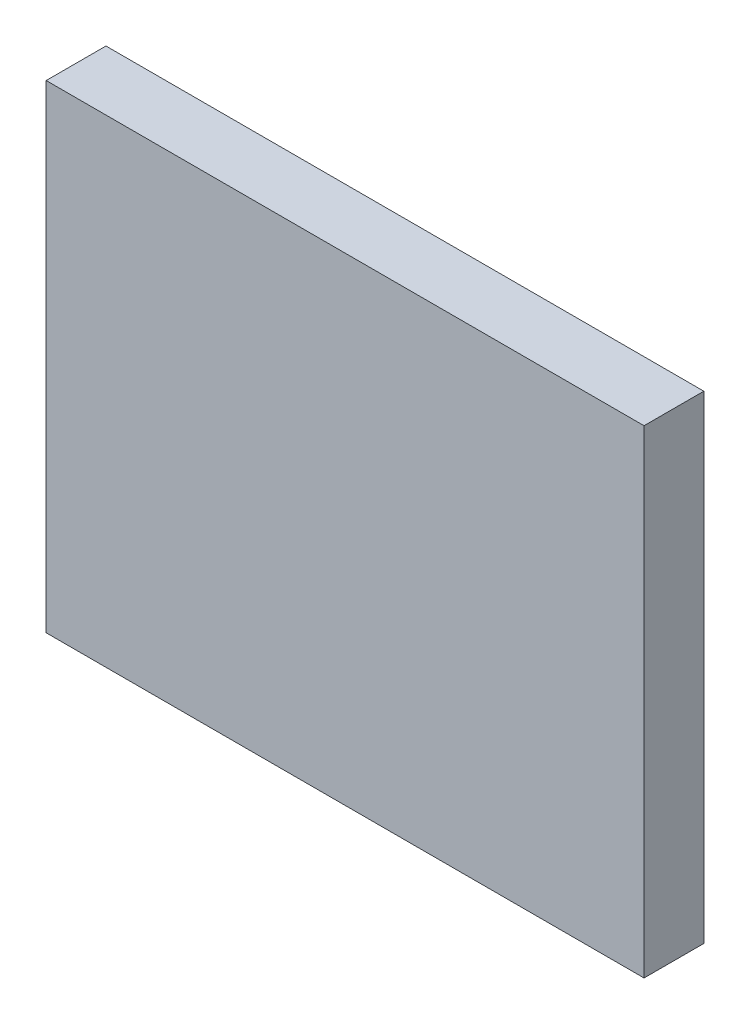
ISO-10303-21;
HEADER;
FILE_DESCRIPTION(('STEP AP214'),'2;1');
FILE_NAME('part.step','',(''),(''),'','','');
FILE_SCHEMA(('AUTOMOTIVE_DESIGN { 1 0 10303 214 1 1 1 1 }'));
ENDSEC;
DATA;
#1=APPLICATION_CONTEXT('core data for automotive mechanical design processes');
#2=APPLICATION_PROTOCOL_DEFINITION('international standard','automotive_design',2000,#1);
#3=PRODUCT_CONTEXT('',#1,'mechanical');
#4=PRODUCT('Part','Part','',(#3));
#5=PRODUCT_RELATED_PRODUCT_CATEGORY('part','',(#4));
#6=PRODUCT_DEFINITION_FORMATION('','',#4);
#7=PRODUCT_DEFINITION_CONTEXT('part definition',#1,'design');
#8=PRODUCT_DEFINITION('design','',#6,#7);
#9=PRODUCT_DEFINITION_SHAPE('','',#8);
#10=(LENGTH_UNIT() NAMED_UNIT(*) SI_UNIT(.MILLI.,.METRE.));
#11=(NAMED_UNIT(*) PLANE_ANGLE_UNIT() SI_UNIT($,.RADIAN.));
#12=(NAMED_UNIT(*) SI_UNIT($,.STERADIAN.) SOLID_ANGLE_UNIT());
#13=UNCERTAINTY_MEASURE_WITH_UNIT(LENGTH_MEASURE(1.E-05),#10,'distance_accuracy_value','');
#14=(GEOMETRIC_REPRESENTATION_CONTEXT(3) GLOBAL_UNCERTAINTY_ASSIGNED_CONTEXT((#13)) GLOBAL_UNIT_ASSIGNED_CONTEXT((#10,
#11,#12)) REPRESENTATION_CONTEXT('',''));
#15=CARTESIAN_POINT('',(0.,0.,0.));
#16=DIRECTION('',(0.,0.,1.));
#17=DIRECTION('',(1.,0.,0.));
#18=AXIS2_PLACEMENT_3D('',#15,#16,#17);
#19=CARTESIAN_POINT('',(2.04,-2.35,0.));
#20=DIRECTION('',(1.,0.,0.));
#21=DIRECTION('',(0.,0.,1.));
#22=AXIS2_PLACEMENT_3D('',#19,#20,#21);
#23=PLANE('',#22);
#24=DIRECTION('',(0.,1.,0.));
#25=VECTOR('',#24,1.);
#26=CARTESIAN_POINT('',(2.04,-2.35,0.1));
#27=LINE('',#26,#25);
#28=CARTESIAN_POINT('',(2.04,-2.35,0.1));
#29=VERTEX_POINT('',#28);
#30=CARTESIAN_POINT('',(2.04,-1.55,0.1));
#31=VERTEX_POINT('',#30);
#32=EDGE_CURVE('E11',#29,#31,#27,.T.);
#33=ORIENTED_EDGE('',*,*,#32,.T.);
#34=DIRECTION('',(0.,0.,1.));
#35=VECTOR('',#34,1.);
#36=CARTESIAN_POINT('',(2.04,-1.55,0.));
#37=LINE('',#36,#35);
#38=CARTESIAN_POINT('',(2.04,-1.55,0.));
#39=VERTEX_POINT('',#38);
#40=EDGE_CURVE('E24',#39,#31,#37,.T.);
#41=ORIENTED_EDGE('',*,*,#40,.F.);
#42=DIRECTION('',(0.,1.,0.));
#43=VECTOR('',#42,1.);
#44=CARTESIAN_POINT('',(2.04,-2.35,0.));
#45=LINE('',#44,#43);
#46=CARTESIAN_POINT('',(2.04,-2.35,0.));
#47=VERTEX_POINT('',#46);
#48=EDGE_CURVE('E86',#47,#39,#45,.T.);
#49=ORIENTED_EDGE('',*,*,#48,.F.);
#50=DIRECTION('',(0.,0.,1.));
#51=VECTOR('',#50,1.);
#52=CARTESIAN_POINT('',(2.04,-2.35,0.));
#53=LINE('',#52,#51);
#54=EDGE_CURVE('E36',#47,#29,#53,.T.);
#55=ORIENTED_EDGE('',*,*,#54,.T.);
#56=EDGE_LOOP('',(#33,#41,#49,#55));
#57=FACE_BOUND('',#56,.T.);
#58=ADVANCED_FACE('F17',(#57),#23,.F.);
#59=CARTESIAN_POINT('',(3.04,-2.35,0.));
#60=DIRECTION('',(1.,0.,0.));
#61=DIRECTION('',(0.,0.,1.));
#62=AXIS2_PLACEMENT_3D('',#59,#60,#61);
#63=PLANE('',#62);
#64=DIRECTION('',(0.,0.,1.));
#65=VECTOR('',#64,1.);
#66=CARTESIAN_POINT('',(3.04,-2.35,0.));
#67=LINE('',#66,#65);
#68=CARTESIAN_POINT('',(3.04,-2.35,0.));
#69=VERTEX_POINT('',#68);
#70=CARTESIAN_POINT('',(3.04,-2.35,0.1));
#71=VERTEX_POINT('',#70);
#72=EDGE_CURVE('E83',#69,#71,#67,.T.);
#73=ORIENTED_EDGE('',*,*,#72,.F.);
#74=DIRECTION('',(0.,1.,0.));
#75=VECTOR('',#74,1.);
#76=CARTESIAN_POINT('',(3.04,-2.35,0.));
#77=LINE('',#76,#75);
#78=CARTESIAN_POINT('',(3.04,-1.55,0.));
#79=VERTEX_POINT('',#78);
#80=EDGE_CURVE('E63',#69,#79,#77,.T.);
#81=ORIENTED_EDGE('',*,*,#80,.T.);
#82=DIRECTION('',(0.,0.,1.));
#83=VECTOR('',#82,1.);
#84=CARTESIAN_POINT('',(3.04,-1.55,0.));
#85=LINE('',#84,#83);
#86=CARTESIAN_POINT('',(3.04,-1.55,0.1));
#87=VERTEX_POINT('',#86);
#88=EDGE_CURVE('E57',#79,#87,#85,.T.);
#89=ORIENTED_EDGE('',*,*,#88,.T.);
#90=DIRECTION('',(0.,1.,0.));
#91=VECTOR('',#90,1.);
#92=CARTESIAN_POINT('',(3.04,-2.35,0.1));
#93=LINE('',#92,#91);
#94=EDGE_CURVE('E60',#71,#87,#93,.T.);
#95=ORIENTED_EDGE('',*,*,#94,.F.);
#96=EDGE_LOOP('',(#73,#81,#89,#95));
#97=FACE_BOUND('',#96,.T.);
#98=ADVANCED_FACE('F59',(#97),#63,.T.);
#99=CARTESIAN_POINT('',(2.04,-2.35,0.));
#100=DIRECTION('',(0.,1.,0.));
#101=DIRECTION('',(0.,0.,1.));
#102=AXIS2_PLACEMENT_3D('',#99,#100,#101);
#103=PLANE('',#102);
#104=ORIENTED_EDGE('',*,*,#72,.T.);
#105=DIRECTION('',(1.,0.,0.));
#106=VECTOR('',#105,1.);
#107=CARTESIAN_POINT('',(2.04,-2.35,0.1));
#108=LINE('',#107,#106);
#109=EDGE_CURVE('E71',#29,#71,#108,.T.);
#110=ORIENTED_EDGE('',*,*,#109,.F.);
#111=ORIENTED_EDGE('',*,*,#54,.F.);
#112=DIRECTION('',(1.,0.,0.));
#113=VECTOR('',#112,1.);
#114=CARTESIAN_POINT('',(2.04,-2.35,0.));
#115=LINE('',#114,#113);
#116=EDGE_CURVE('E76',#47,#69,#115,.T.);
#117=ORIENTED_EDGE('',*,*,#116,.T.);
#118=EDGE_LOOP('',(#104,#110,#111,#117));
#119=FACE_BOUND('',#118,.T.);
#120=ADVANCED_FACE('F91',(#119),#103,.F.);
#121=CARTESIAN_POINT('',(2.04,-1.55,0.));
#122=DIRECTION('',(0.,1.,0.));
#123=DIRECTION('',(0.,0.,1.));
#124=AXIS2_PLACEMENT_3D('',#121,#122,#123);
#125=PLANE('',#124);
#126=DIRECTION('',(1.,0.,0.));
#127=VECTOR('',#126,1.);
#128=CARTESIAN_POINT('',(2.04,-1.55,0.));
#129=LINE('',#128,#127);
#130=EDGE_CURVE('E74',#39,#79,#129,.T.);
#131=ORIENTED_EDGE('',*,*,#130,.F.);
#132=ORIENTED_EDGE('',*,*,#40,.T.);
#133=DIRECTION('',(1.,0.,0.));
#134=VECTOR('',#133,1.);
#135=CARTESIAN_POINT('',(2.04,-1.55,0.1));
#136=LINE('',#135,#134);
#137=EDGE_CURVE('E69',#31,#87,#136,.T.);
#138=ORIENTED_EDGE('',*,*,#137,.T.);
#139=ORIENTED_EDGE('',*,*,#88,.F.);
#140=EDGE_LOOP('',(#131,#132,#138,#139));
#141=FACE_BOUND('',#140,.T.);
#142=ADVANCED_FACE('F73',(#141),#125,.T.);
#143=CARTESIAN_POINT('',(2.04,-2.35,0.));
#144=DIRECTION('',(0.,0.,1.));
#145=DIRECTION('',(1.,0.,0.));
#146=AXIS2_PLACEMENT_3D('',#143,#144,#145);
#147=PLANE('',#146);
#148=ORIENTED_EDGE('',*,*,#130,.T.);
#149=ORIENTED_EDGE('',*,*,#80,.F.);
#150=ORIENTED_EDGE('',*,*,#116,.F.);
#151=ORIENTED_EDGE('',*,*,#48,.T.);
#152=EDGE_LOOP('',(#148,#149,#150,#151));
#153=FACE_BOUND('',#152,.T.);
#154=ADVANCED_FACE('F89',(#153),#147,.F.);
#155=CARTESIAN_POINT('',(2.04,-2.35,0.1));
#156=DIRECTION('',(0.,0.,1.));
#157=DIRECTION('',(1.,0.,0.));
#158=AXIS2_PLACEMENT_3D('',#155,#156,#157);
#159=PLANE('',#158);
#160=ORIENTED_EDGE('',*,*,#32,.F.);
#161=ORIENTED_EDGE('',*,*,#109,.T.);
#162=ORIENTED_EDGE('',*,*,#94,.T.);
#163=ORIENTED_EDGE('',*,*,#137,.F.);
#164=EDGE_LOOP('',(#160,#161,#162,#163));
#165=FACE_BOUND('',#164,.T.);
#166=ADVANCED_FACE('F68',(#165),#159,.T.);
#167=CLOSED_SHELL('',(#58,#98,#120,#142,#154,#166));
#168=MANIFOLD_SOLID_BREP('B1',#167);
#169=ADVANCED_BREP_SHAPE_REPRESENTATION('',(#18,#168),#14);
#170=SHAPE_DEFINITION_REPRESENTATION(#9,#169);
ENDSEC;
END-ISO-10303-21;
